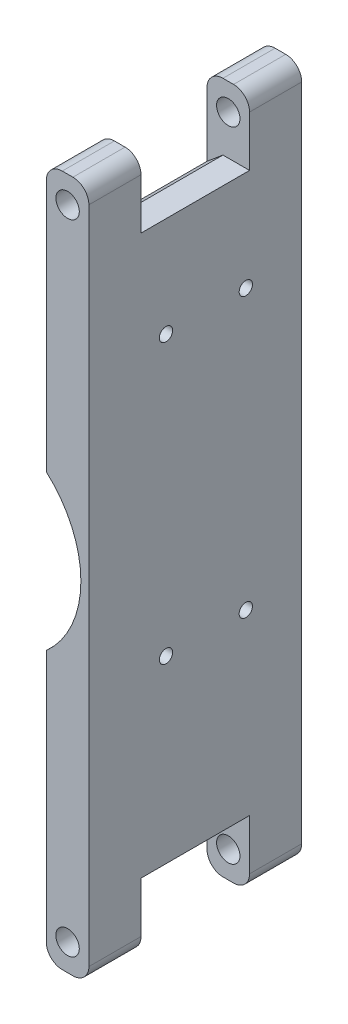
ISO-10303-21;
HEADER;
FILE_DESCRIPTION(('STEP AP214'),'2;1');
FILE_NAME('part.step','',(''),(''),'','','');
FILE_SCHEMA(('AUTOMOTIVE_DESIGN { 1 0 10303 214 1 1 1 1 }'));
ENDSEC;
DATA;
#1=APPLICATION_CONTEXT('core data for automotive mechanical design processes');
#2=APPLICATION_PROTOCOL_DEFINITION('international standard','automotive_design',2000,#1);
#3=PRODUCT_CONTEXT('',#1,'mechanical');
#4=PRODUCT('Part','Part','',(#3));
#5=PRODUCT_RELATED_PRODUCT_CATEGORY('part','',(#4));
#6=PRODUCT_DEFINITION_FORMATION('','',#4);
#7=PRODUCT_DEFINITION_CONTEXT('part definition',#1,'design');
#8=PRODUCT_DEFINITION('design','',#6,#7);
#9=PRODUCT_DEFINITION_SHAPE('','',#8);
#10=(LENGTH_UNIT() NAMED_UNIT(*) SI_UNIT(.MILLI.,.METRE.));
#11=(NAMED_UNIT(*) PLANE_ANGLE_UNIT() SI_UNIT($,.RADIAN.));
#12=(NAMED_UNIT(*) SI_UNIT($,.STERADIAN.) SOLID_ANGLE_UNIT());
#13=UNCERTAINTY_MEASURE_WITH_UNIT(LENGTH_MEASURE(1.E-05),#10,'distance_accuracy_value','');
#14=(GEOMETRIC_REPRESENTATION_CONTEXT(3) GLOBAL_UNCERTAINTY_ASSIGNED_CONTEXT((#13)) GLOBAL_UNIT_ASSIGNED_CONTEXT((#10,
#11,#12)) REPRESENTATION_CONTEXT('',''));
#15=CARTESIAN_POINT('',(0.,0.,0.));
#16=DIRECTION('',(0.,0.,1.));
#17=DIRECTION('',(1.,0.,0.));
#18=AXIS2_PLACEMENT_3D('',#15,#16,#17);
#19=CARTESIAN_POINT('',(-3.99999999999999,-65.,-40.));
#20=DIRECTION('',(0.,-1.,0.));
#21=DIRECTION('',(0.,0.,-1.));
#22=AXIS2_PLACEMENT_3D('',#19,#20,#21);
#23=PLANE('',#22);
#24=DIRECTION('',(1.,0.,0.));
#25=VECTOR('',#24,1.);
#26=CARTESIAN_POINT('',(-3.99999999999999,-65.,0.));
#27=LINE('',#26,#25);
#28=CARTESIAN_POINT('',(-0.99999999999999,-65.,0.));
#29=VERTEX_POINT('',#28);
#30=CARTESIAN_POINT('',(1.00000000000001,-65.,0.));
#31=VERTEX_POINT('',#30);
#32=EDGE_CURVE('E394',#29,#31,#27,.T.);
#33=ORIENTED_EDGE('',*,*,#32,.F.);
#34=DIRECTION('',(0.,0.,1.));
#35=VECTOR('',#34,1.);
#36=CARTESIAN_POINT('',(-0.99999999999999,-65.,-40.));
#37=LINE('',#36,#35);
#38=CARTESIAN_POINT('',(-0.99999999999999,-65.,-9.8));
#39=VERTEX_POINT('',#38);
#40=EDGE_CURVE('E311',#29,#39,#37,.F.);
#41=ORIENTED_EDGE('',*,*,#40,.T.);
#42=DIRECTION('',(-1.,0.,0.));
#43=VECTOR('',#42,1.);
#44=CARTESIAN_POINT('',(-3.99999999999999,-65.,-9.8));
#45=LINE('',#44,#43);
#46=CARTESIAN_POINT('',(1.00000000000001,-65.,-9.8));
#47=VERTEX_POINT('',#46);
#48=EDGE_CURVE('E386',#47,#39,#45,.T.);
#49=ORIENTED_EDGE('',*,*,#48,.F.);
#50=DIRECTION('',(0.,0.,1.));
#51=VECTOR('',#50,1.);
#52=CARTESIAN_POINT('',(1.00000000000001,-65.,-40.));
#53=LINE('',#52,#51);
#54=EDGE_CURVE('E308',#47,#31,#53,.T.);
#55=ORIENTED_EDGE('',*,*,#54,.T.);
#56=EDGE_LOOP('',(#33,#41,#49,#55));
#57=FACE_BOUND('',#56,.T.);
#58=ADVANCED_FACE('F39',(#57),#23,.T.);
#59=CARTESIAN_POINT('',(-4.00000000000001,65.,-40.));
#60=DIRECTION('',(0.,1.,0.));
#61=DIRECTION('',(0.,0.,1.));
#62=AXIS2_PLACEMENT_3D('',#59,#60,#61);
#63=PLANE('',#62);
#64=DIRECTION('',(-1.,0.,0.));
#65=VECTOR('',#64,1.);
#66=CARTESIAN_POINT('',(-4.00000000000001,65.,-40.));
#67=LINE('',#66,#65);
#68=CARTESIAN_POINT('',(0.999999999999995,65.,-40.));
#69=VERTEX_POINT('',#68);
#70=CARTESIAN_POINT('',(-1.00000000000001,65.,-40.));
#71=VERTEX_POINT('',#70);
#72=EDGE_CURVE('E393',#69,#71,#67,.T.);
#73=ORIENTED_EDGE('',*,*,#72,.T.);
#74=DIRECTION('',(0.,0.,1.));
#75=VECTOR('',#74,1.);
#76=CARTESIAN_POINT('',(-1.00000000000001,65.,-40.));
#77=LINE('',#76,#75);
#78=CARTESIAN_POINT('',(-1.00000000000001,65.,-30.2));
#79=VERTEX_POINT('',#78);
#80=EDGE_CURVE('E328',#71,#79,#77,.T.);
#81=ORIENTED_EDGE('',*,*,#80,.T.);
#82=DIRECTION('',(-1.,0.,0.));
#83=VECTOR('',#82,1.);
#84=CARTESIAN_POINT('',(-4.00000000000001,65.,-30.2));
#85=LINE('',#84,#83);
#86=CARTESIAN_POINT('',(0.999999999999995,65.,-30.2));
#87=VERTEX_POINT('',#86);
#88=EDGE_CURVE('E260',#87,#79,#85,.T.);
#89=ORIENTED_EDGE('',*,*,#88,.F.);
#90=DIRECTION('',(0.,0.,1.));
#91=VECTOR('',#90,1.);
#92=CARTESIAN_POINT('',(0.999999999999995,65.,-40.));
#93=LINE('',#92,#91);
#94=EDGE_CURVE('E326',#87,#69,#93,.F.);
#95=ORIENTED_EDGE('',*,*,#94,.T.);
#96=EDGE_LOOP('',(#73,#81,#89,#95));
#97=FACE_BOUND('',#96,.T.);
#98=ADVANCED_FACE('F456',(#97),#63,.T.);
#99=CARTESIAN_POINT('',(3.99999999999999,65.,-40.));
#100=DIRECTION('',(1.,0.,0.));
#101=DIRECTION('',(0.,1.,0.));
#102=AXIS2_PLACEMENT_3D('',#99,#100,#101);
#103=PLANE('',#102);
#104=CARTESIAN_POINT('',(4.,-18.7,-29.5));
#105=DIRECTION('',(1.,0.,0.));
#106=DIRECTION('',(0.,1.,0.));
#107=AXIS2_PLACEMENT_3D('',#104,#105,#106);
#108=CIRCLE('',#107,1.25);
#109=CARTESIAN_POINT('',(4.,-17.45,-29.5));
#110=VERTEX_POINT('',#109);
#111=EDGE_CURVE('E579',#110,#110,#108,.F.);
#112=ORIENTED_EDGE('',*,*,#111,.T.);
#113=EDGE_LOOP('',(#112));
#114=FACE_BOUND('',#113,.T.);
#115=CARTESIAN_POINT('',(4.,33.7,-14.5));
#116=DIRECTION('',(1.,0.,0.));
#117=DIRECTION('',(0.,1.,0.));
#118=AXIS2_PLACEMENT_3D('',#115,#116,#117);
#119=CIRCLE('',#118,1.25);
#120=CARTESIAN_POINT('',(4.,34.95,-14.5));
#121=VERTEX_POINT('',#120);
#122=EDGE_CURVE('E586',#121,#121,#119,.F.);
#123=ORIENTED_EDGE('',*,*,#122,.T.);
#124=EDGE_LOOP('',(#123));
#125=FACE_BOUND('',#124,.T.);
#126=CARTESIAN_POINT('',(4.,-18.7,-14.5));
#127=DIRECTION('',(1.,0.,0.));
#128=DIRECTION('',(0.,1.,0.));
#129=AXIS2_PLACEMENT_3D('',#126,#127,#128);
#130=CIRCLE('',#129,1.25);
#131=CARTESIAN_POINT('',(4.,-17.45,-14.5));
#132=VERTEX_POINT('',#131);
#133=EDGE_CURVE('E570',#132,#132,#130,.F.);
#134=ORIENTED_EDGE('',*,*,#133,.T.);
#135=EDGE_LOOP('',(#134));
#136=FACE_BOUND('',#135,.T.);
#137=CARTESIAN_POINT('',(4.,33.7,-29.5));
#138=DIRECTION('',(1.,0.,0.));
#139=DIRECTION('',(0.,1.,0.));
#140=AXIS2_PLACEMENT_3D('',#137,#138,#139);
#141=CIRCLE('',#140,1.25);
#142=CARTESIAN_POINT('',(4.,34.95,-29.5));
#143=VERTEX_POINT('',#142);
#144=EDGE_CURVE('E582',#143,#143,#141,.F.);
#145=ORIENTED_EDGE('',*,*,#144,.T.);
#146=EDGE_LOOP('',(#145));
#147=FACE_BOUND('',#146,.T.);
#148=DIRECTION('',(0.,1.,0.));
#149=VECTOR('',#148,1.);
#150=CARTESIAN_POINT('',(4.00000000000001,-77.5,-30.2));
#151=LINE('',#150,#149);
#152=CARTESIAN_POINT('',(4.00000000000001,-62.,-30.2));
#153=VERTEX_POINT('',#152);
#154=CARTESIAN_POINT('',(4.00000000000001,-52.5,-30.2));
#155=VERTEX_POINT('',#154);
#156=EDGE_CURVE('E379',#153,#155,#151,.T.);
#157=ORIENTED_EDGE('',*,*,#156,.F.);
#158=DIRECTION('',(0.,0.,1.));
#159=VECTOR('',#158,1.);
#160=CARTESIAN_POINT('',(4.00000000000001,-62.,-40.));
#161=LINE('',#160,#159);
#162=CARTESIAN_POINT('',(4.00000000000001,-62.,-40.));
#163=VERTEX_POINT('',#162);
#164=EDGE_CURVE('E298',#153,#163,#161,.F.);
#165=ORIENTED_EDGE('',*,*,#164,.T.);
#166=DIRECTION('',(0.,1.,0.));
#167=VECTOR('',#166,1.);
#168=CARTESIAN_POINT('',(3.99999999999999,65.,-40.));
#169=LINE('',#168,#167);
#170=CARTESIAN_POINT('',(3.99999999999999,62.,-40.));
#171=VERTEX_POINT('',#170);
#172=EDGE_CURVE('E390',#163,#171,#169,.T.);
#173=ORIENTED_EDGE('',*,*,#172,.T.);
#174=DIRECTION('',(0.,0.,1.));
#175=VECTOR('',#174,1.);
#176=CARTESIAN_POINT('',(3.99999999999999,62.,-40.));
#177=LINE('',#176,#175);
#178=CARTESIAN_POINT('',(3.99999999999999,62.,-30.2));
#179=VERTEX_POINT('',#178);
#180=EDGE_CURVE('E293',#171,#179,#177,.T.);
#181=ORIENTED_EDGE('',*,*,#180,.T.);
#182=DIRECTION('',(0.,1.,0.));
#183=VECTOR('',#182,1.);
#184=CARTESIAN_POINT('',(3.99999999999999,77.5,-30.2));
#185=LINE('',#184,#183);
#186=CARTESIAN_POINT('',(4.,52.5,-30.2));
#187=VERTEX_POINT('',#186);
#188=EDGE_CURVE('E361',#187,#179,#185,.T.);
#189=ORIENTED_EDGE('',*,*,#188,.F.);
#190=DIRECTION('',(0.,0.,-1.));
#191=VECTOR('',#190,1.);
#192=CARTESIAN_POINT('',(4.,52.5,-9.8));
#193=LINE('',#192,#191);
#194=CARTESIAN_POINT('',(4.,52.5,-9.8));
#195=VERTEX_POINT('',#194);
#196=EDGE_CURVE('E358',#195,#187,#193,.T.);
#197=ORIENTED_EDGE('',*,*,#196,.F.);
#198=DIRECTION('',(0.,-1.,0.));
#199=VECTOR('',#198,1.);
#200=CARTESIAN_POINT('',(3.99999999999999,77.5,-9.8));
#201=LINE('',#200,#199);
#202=CARTESIAN_POINT('',(3.99999999999999,62.,-9.8));
#203=VERTEX_POINT('',#202);
#204=EDGE_CURVE('E364',#203,#195,#201,.T.);
#205=ORIENTED_EDGE('',*,*,#204,.F.);
#206=DIRECTION('',(0.,0.,1.));
#207=VECTOR('',#206,1.);
#208=CARTESIAN_POINT('',(3.99999999999999,62.,-40.));
#209=LINE('',#208,#207);
#210=CARTESIAN_POINT('',(3.99999999999999,62.,0.));
#211=VERTEX_POINT('',#210);
#212=EDGE_CURVE('E290',#203,#211,#209,.T.);
#213=ORIENTED_EDGE('',*,*,#212,.T.);
#214=DIRECTION('',(0.,1.,0.));
#215=VECTOR('',#214,1.);
#216=CARTESIAN_POINT('',(3.99999999999999,65.,0.));
#217=LINE('',#216,#215);
#218=CARTESIAN_POINT('',(4.00000000000001,-62.,0.));
#219=VERTEX_POINT('',#218);
#220=EDGE_CURVE('E389',#219,#211,#217,.T.);
#221=ORIENTED_EDGE('',*,*,#220,.F.);
#222=DIRECTION('',(0.,0.,1.));
#223=VECTOR('',#222,1.);
#224=CARTESIAN_POINT('',(4.00000000000001,-62.,-40.));
#225=LINE('',#224,#223);
#226=CARTESIAN_POINT('',(4.00000000000001,-62.,-9.8));
#227=VERTEX_POINT('',#226);
#228=EDGE_CURVE('E296',#219,#227,#225,.F.);
#229=ORIENTED_EDGE('',*,*,#228,.T.);
#230=DIRECTION('',(0.,-1.,0.));
#231=VECTOR('',#230,1.);
#232=CARTESIAN_POINT('',(4.00000000000001,-77.5,-9.8));
#233=LINE('',#232,#231);
#234=CARTESIAN_POINT('',(4.00000000000001,-52.5,-9.8));
#235=VERTEX_POINT('',#234);
#236=EDGE_CURVE('E365',#235,#227,#233,.T.);
#237=ORIENTED_EDGE('',*,*,#236,.F.);
#238=DIRECTION('',(0.,0.,1.));
#239=VECTOR('',#238,1.);
#240=CARTESIAN_POINT('',(4.00000000000001,-52.5,-9.8));
#241=LINE('',#240,#239);
#242=EDGE_CURVE('E376',#155,#235,#241,.T.);
#243=ORIENTED_EDGE('',*,*,#242,.F.);
#244=EDGE_LOOP('',(#157,#165,#173,#181,#189,#197,#205,#213,#221,#229,#237,#243));
#245=FACE_BOUND('',#244,.T.);
#246=ADVANCED_FACE('F428',(#114,#125,#136,#147,#245),#103,.T.);
#247=DIRECTION('',(1.,0.,0.));
#248=VECTOR('',#247,1.);
#249=CARTESIAN_POINT('',(-3.99999999999999,-65.,-30.2));
#250=LINE('',#249,#248);
#251=CARTESIAN_POINT('',(-0.99999999999999,-65.,-30.2));
#252=VERTEX_POINT('',#251);
#253=CARTESIAN_POINT('',(1.00000000000001,-65.,-30.2));
#254=VERTEX_POINT('',#253);
#255=EDGE_CURVE('E372',#252,#254,#250,.T.);
#256=ORIENTED_EDGE('',*,*,#255,.F.);
#257=DIRECTION('',(0.,0.,1.));
#258=VECTOR('',#257,1.);
#259=CARTESIAN_POINT('',(-0.99999999999999,-65.,-40.));
#260=LINE('',#259,#258);
#261=CARTESIAN_POINT('',(-0.99999999999999,-65.,-40.));
#262=VERTEX_POINT('',#261);
#263=EDGE_CURVE('E280',#252,#262,#260,.F.);
#264=ORIENTED_EDGE('',*,*,#263,.T.);
#265=DIRECTION('',(1.,0.,0.));
#266=VECTOR('',#265,1.);
#267=CARTESIAN_POINT('',(-3.99999999999999,-65.,-40.));
#268=LINE('',#267,#266);
#269=CARTESIAN_POINT('',(1.00000000000001,-65.,-40.));
#270=VERTEX_POINT('',#269);
#271=EDGE_CURVE('E399',#262,#270,#268,.T.);
#272=ORIENTED_EDGE('',*,*,#271,.T.);
#273=DIRECTION('',(0.,0.,1.));
#274=VECTOR('',#273,1.);
#275=CARTESIAN_POINT('',(1.00000000000001,-65.,-40.));
#276=LINE('',#275,#274);
#277=EDGE_CURVE('E277',#270,#254,#276,.T.);
#278=ORIENTED_EDGE('',*,*,#277,.T.);
#279=EDGE_LOOP('',(#256,#264,#272,#278));
#280=FACE_BOUND('',#279,.T.);
#281=ADVANCED_FACE('F463',(#280),#23,.T.);
#282=CARTESIAN_POINT('',(-4.00000000000001,65.,-40.));
#283=DIRECTION('',(-1.,0.,0.));
#284=DIRECTION('',(0.,-1.,0.));
#285=AXIS2_PLACEMENT_3D('',#282,#283,#284);
#286=PLANE('',#285);
#287=CARTESIAN_POINT('',(-4.,-18.7,-29.5));
#288=DIRECTION('',(-1.,0.,0.));
#289=DIRECTION('',(0.,1.,0.));
#290=AXIS2_PLACEMENT_3D('',#287,#288,#289);
#291=CIRCLE('',#290,1.25);
#292=CARTESIAN_POINT('',(-4.,-17.45,-29.5));
#293=VERTEX_POINT('',#292);
#294=EDGE_CURVE('E583',#293,#293,#291,.T.);
#295=ORIENTED_EDGE('',*,*,#294,.F.);
#296=EDGE_LOOP('',(#295));
#297=FACE_BOUND('',#296,.T.);
#298=CARTESIAN_POINT('',(-4.,33.7,-14.5));
#299=DIRECTION('',(-1.,0.,0.));
#300=DIRECTION('',(0.,1.,0.));
#301=AXIS2_PLACEMENT_3D('',#298,#299,#300);
#302=CIRCLE('',#301,1.25);
#303=CARTESIAN_POINT('',(-4.,34.95,-14.5));
#304=VERTEX_POINT('',#303);
#305=EDGE_CURVE('E576',#304,#304,#302,.T.);
#306=ORIENTED_EDGE('',*,*,#305,.F.);
#307=EDGE_LOOP('',(#306));
#308=FACE_BOUND('',#307,.T.);
#309=CARTESIAN_POINT('',(-4.,-18.7,-14.5));
#310=DIRECTION('',(-1.,0.,0.));
#311=DIRECTION('',(0.,-1.,0.));
#312=AXIS2_PLACEMENT_3D('',#309,#310,#311);
#313=CIRCLE('',#312,1.25);
#314=CARTESIAN_POINT('',(-4.,-19.95,-14.5));
#315=VERTEX_POINT('',#314);
#316=EDGE_CURVE('E573',#315,#315,#313,.T.);
#317=ORIENTED_EDGE('',*,*,#316,.F.);
#318=EDGE_LOOP('',(#317));
#319=FACE_BOUND('',#318,.T.);
#320=CARTESIAN_POINT('',(-4.,33.7,-29.5));
#321=DIRECTION('',(-1.,0.,0.));
#322=DIRECTION('',(0.,-1.,0.));
#323=AXIS2_PLACEMENT_3D('',#320,#321,#322);
#324=CIRCLE('',#323,1.25);
#325=CARTESIAN_POINT('',(-4.,32.45,-29.5));
#326=VERTEX_POINT('',#325);
#327=EDGE_CURVE('E216',#326,#326,#324,.T.);
#328=ORIENTED_EDGE('',*,*,#327,.F.);
#329=EDGE_LOOP('',(#328));
#330=FACE_BOUND('',#329,.T.);
#331=DIRECTION('',(0.,0.,1.));
#332=VECTOR('',#331,1.);
#333=CARTESIAN_POINT('',(-3.99999999999999,-49.9827011064682,-9.8));
#334=LINE('',#333,#332);
#335=CARTESIAN_POINT('',(-3.99999999999999,-49.9827011064682,-30.2));
#336=VERTEX_POINT('',#335);
#337=CARTESIAN_POINT('',(-3.99999999999999,-49.9827011064682,-9.8));
#338=VERTEX_POINT('',#337);
#339=EDGE_CURVE('E224',#336,#338,#334,.T.);
#340=ORIENTED_EDGE('',*,*,#339,.T.);
#341=DIRECTION('',(0.,-1.,0.));
#342=VECTOR('',#341,1.);
#343=CARTESIAN_POINT('',(-4.,-77.5,-9.8));
#344=LINE('',#343,#342);
#345=CARTESIAN_POINT('',(-4.00000000000001,-62.,-9.8));
#346=VERTEX_POINT('',#345);
#347=EDGE_CURVE('E253',#338,#346,#344,.T.);
#348=ORIENTED_EDGE('',*,*,#347,.T.);
#349=DIRECTION('',(0.,0.,1.));
#350=VECTOR('',#349,1.);
#351=CARTESIAN_POINT('',(-3.99999999999999,-62.,-40.));
#352=LINE('',#351,#350);
#353=CARTESIAN_POINT('',(-3.99999999999999,-62.,0.));
#354=VERTEX_POINT('',#353);
#355=EDGE_CURVE('E270',#346,#354,#352,.T.);
#356=ORIENTED_EDGE('',*,*,#355,.T.);
#357=DIRECTION('',(0.,-1.,0.));
#358=VECTOR('',#357,1.);
#359=CARTESIAN_POINT('',(-4.00000000000001,65.,0.));
#360=LINE('',#359,#358);
#361=CARTESIAN_POINT('',(-4.,-14.5344418537486,0.));
#362=VERTEX_POINT('',#361);
#363=EDGE_CURVE('E407',#362,#354,#360,.T.);
#364=ORIENTED_EDGE('',*,*,#363,.F.);
#365=DIRECTION('',(0.,0.,1.));
#366=VECTOR('',#365,1.);
#367=CARTESIAN_POINT('',(-4.,-14.5344418537486,-7.3));
#368=LINE('',#367,#366);
#369=CARTESIAN_POINT('',(-4.,-14.5344418537486,-7.3));
#370=VERTEX_POINT('',#369);
#371=EDGE_CURVE('E211',#370,#362,#368,.T.);
#372=ORIENTED_EDGE('',*,*,#371,.F.);
#373=DIRECTION('',(0.,1.,0.));
#374=VECTOR('',#373,1.);
#375=CARTESIAN_POINT('',(-4.00000000000001,65.,-7.3));
#376=LINE('',#375,#374);
#377=CARTESIAN_POINT('',(-4.,14.5344418537486,-7.3));
#378=VERTEX_POINT('',#377);
#379=EDGE_CURVE('E215',#370,#378,#376,.T.);
#380=ORIENTED_EDGE('',*,*,#379,.T.);
#381=DIRECTION('',(0.,0.,1.));
#382=VECTOR('',#381,1.);
#383=CARTESIAN_POINT('',(-4.,14.5344418537486,-7.3));
#384=LINE('',#383,#382);
#385=CARTESIAN_POINT('',(-4.,14.5344418537486,0.));
#386=VERTEX_POINT('',#385);
#387=EDGE_CURVE('E200',#386,#378,#384,.F.);
#388=ORIENTED_EDGE('',*,*,#387,.F.);
#389=CARTESIAN_POINT('',(-4.00000000000001,62.,0.));
#390=VERTEX_POINT('',#389);
#391=EDGE_CURVE('E408',#390,#386,#360,.T.);
#392=ORIENTED_EDGE('',*,*,#391,.F.);
#393=DIRECTION('',(0.,0.,1.));
#394=VECTOR('',#393,1.);
#395=CARTESIAN_POINT('',(-4.00000000000001,62.,-40.));
#396=LINE('',#395,#394);
#397=CARTESIAN_POINT('',(-4.00000000000002,62.,-9.8));
#398=VERTEX_POINT('',#397);
#399=EDGE_CURVE('E262',#390,#398,#396,.F.);
#400=ORIENTED_EDGE('',*,*,#399,.T.);
#401=DIRECTION('',(0.,-1.,0.));
#402=VECTOR('',#401,1.);
#403=CARTESIAN_POINT('',(-4.00000000000002,77.5,-9.8));
#404=LINE('',#403,#402);
#405=CARTESIAN_POINT('',(-4.00000000000002,49.9827011064681,-9.8));
#406=VERTEX_POINT('',#405);
#407=EDGE_CURVE('E357',#398,#406,#404,.T.);
#408=ORIENTED_EDGE('',*,*,#407,.T.);
#409=DIRECTION('',(0.,0.,-1.));
#410=VECTOR('',#409,1.);
#411=CARTESIAN_POINT('',(-4.,49.9827011064681,-30.2));
#412=LINE('',#411,#410);
#413=CARTESIAN_POINT('',(-4.,49.9827011064681,-30.2));
#414=VERTEX_POINT('',#413);
#415=EDGE_CURVE('E221',#406,#414,#412,.T.);
#416=ORIENTED_EDGE('',*,*,#415,.T.);
#417=DIRECTION('',(0.,1.,0.));
#418=VECTOR('',#417,1.);
#419=CARTESIAN_POINT('',(-4.00000000000002,77.5,-30.2));
#420=LINE('',#419,#418);
#421=CARTESIAN_POINT('',(-4.00000000000002,62.,-30.2));
#422=VERTEX_POINT('',#421);
#423=EDGE_CURVE('E354',#414,#422,#420,.T.);
#424=ORIENTED_EDGE('',*,*,#423,.T.);
#425=DIRECTION('',(0.,0.,1.));
#426=VECTOR('',#425,1.);
#427=CARTESIAN_POINT('',(-4.00000000000001,62.,-40.));
#428=LINE('',#427,#426);
#429=CARTESIAN_POINT('',(-4.00000000000001,62.,-40.));
#430=VERTEX_POINT('',#429);
#431=EDGE_CURVE('E259',#422,#430,#428,.F.);
#432=ORIENTED_EDGE('',*,*,#431,.T.);
#433=DIRECTION('',(0.,-1.,0.));
#434=VECTOR('',#433,1.);
#435=CARTESIAN_POINT('',(-4.00000000000001,65.,-40.));
#436=LINE('',#435,#434);
#437=CARTESIAN_POINT('',(-3.99999999999999,-62.,-40.));
#438=VERTEX_POINT('',#437);
#439=EDGE_CURVE('E397',#430,#438,#436,.T.);
#440=ORIENTED_EDGE('',*,*,#439,.T.);
#441=DIRECTION('',(0.,0.,1.));
#442=VECTOR('',#441,1.);
#443=CARTESIAN_POINT('',(-3.99999999999999,-62.,-40.));
#444=LINE('',#443,#442);
#445=CARTESIAN_POINT('',(-3.99999999999999,-62.,-30.2));
#446=VERTEX_POINT('',#445);
#447=EDGE_CURVE('E258',#438,#446,#444,.T.);
#448=ORIENTED_EDGE('',*,*,#447,.T.);
#449=DIRECTION('',(0.,-1.,0.));
#450=VECTOR('',#449,1.);
#451=CARTESIAN_POINT('',(-4.00000000000001,65.,-30.2));
#452=LINE('',#451,#450);
#453=EDGE_CURVE('E244',#336,#446,#452,.T.);
#454=ORIENTED_EDGE('',*,*,#453,.F.);
#455=EDGE_LOOP('',(#340,#348,#356,#364,#372,#380,#388,#392,#400,#408,#416,#424,#432,#440,#448,#454));
#456=FACE_BOUND('',#455,.T.);
#457=ADVANCED_FACE('F219',(#297,#308,#319,#330,#456),#286,.T.);
#458=DIRECTION('',(1.,0.,0.));
#459=VECTOR('',#458,1.);
#460=CARTESIAN_POINT('',(-4.00000000000001,65.,-9.8));
#461=LINE('',#460,#459);
#462=CARTESIAN_POINT('',(-1.00000000000001,65.,-9.8));
#463=VERTEX_POINT('',#462);
#464=CARTESIAN_POINT('',(0.999999999999995,65.,-9.8));
#465=VERTEX_POINT('',#464);
#466=EDGE_CURVE('E265',#463,#465,#461,.T.);
#467=ORIENTED_EDGE('',*,*,#466,.F.);
#468=DIRECTION('',(0.,0.,1.));
#469=VECTOR('',#468,1.);
#470=CARTESIAN_POINT('',(-1.00000000000001,65.,-40.));
#471=LINE('',#470,#469);
#472=CARTESIAN_POINT('',(-1.00000000000001,65.,0.));
#473=VERTEX_POINT('',#472);
#474=EDGE_CURVE('E319',#463,#473,#471,.T.);
#475=ORIENTED_EDGE('',*,*,#474,.T.);
#476=DIRECTION('',(-1.,0.,0.));
#477=VECTOR('',#476,1.);
#478=CARTESIAN_POINT('',(-4.00000000000001,65.,0.));
#479=LINE('',#478,#477);
#480=CARTESIAN_POINT('',(0.999999999999995,65.,0.));
#481=VERTEX_POINT('',#480);
#482=EDGE_CURVE('E404',#481,#473,#479,.T.);
#483=ORIENTED_EDGE('',*,*,#482,.F.);
#484=DIRECTION('',(0.,0.,1.));
#485=VECTOR('',#484,1.);
#486=CARTESIAN_POINT('',(0.999999999999995,65.,-40.));
#487=LINE('',#486,#485);
#488=EDGE_CURVE('E317',#481,#465,#487,.F.);
#489=ORIENTED_EDGE('',*,*,#488,.T.);
#490=EDGE_LOOP('',(#467,#475,#483,#489));
#491=FACE_BOUND('',#490,.T.);
#492=ADVANCED_FACE('F452',(#491),#63,.T.);
#493=CARTESIAN_POINT('',(0.,0.,-40.));
#494=DIRECTION('',(0.,0.,1.));
#495=DIRECTION('',(1.,0.,0.));
#496=AXIS2_PLACEMENT_3D('',#493,#494,#495);
#497=PLANE('',#496);
#498=CARTESIAN_POINT('',(0.,60.,-40.));
#499=DIRECTION('',(0.,0.,1.));
#500=DIRECTION('',(1.,0.,0.));
#501=AXIS2_PLACEMENT_3D('',#498,#499,#500);
#502=CIRCLE('',#501,2.2);
#503=CARTESIAN_POINT('',(2.2,60.,-40.));
#504=VERTEX_POINT('',#503);
#505=EDGE_CURVE('E337',#504,#504,#502,.T.);
#506=ORIENTED_EDGE('',*,*,#505,.T.);
#507=EDGE_LOOP('',(#506));
#508=FACE_BOUND('',#507,.T.);
#509=CARTESIAN_POINT('',(0.,-60.,-40.));
#510=DIRECTION('',(0.,0.,1.));
#511=DIRECTION('',(-1.,0.,0.));
#512=AXIS2_PLACEMENT_3D('',#509,#510,#511);
#513=CIRCLE('',#512,2.2);
#514=CARTESIAN_POINT('',(-2.2,-60.,-40.));
#515=VERTEX_POINT('',#514);
#516=EDGE_CURVE('E351',#515,#515,#513,.T.);
#517=ORIENTED_EDGE('',*,*,#516,.T.);
#518=EDGE_LOOP('',(#517));
#519=FACE_BOUND('',#518,.T.);
#520=ORIENTED_EDGE('',*,*,#271,.F.);
#521=CARTESIAN_POINT('',(-0.99999999999999,-62.,-40.));
#522=DIRECTION('',(0.,0.,1.));
#523=DIRECTION('',(1.,0.,0.));
#524=AXIS2_PLACEMENT_3D('',#521,#522,#523);
#525=CIRCLE('',#524,3.);
#526=EDGE_CURVE('E288',#262,#438,#525,.F.);
#527=ORIENTED_EDGE('',*,*,#526,.T.);
#528=ORIENTED_EDGE('',*,*,#439,.F.);
#529=CARTESIAN_POINT('',(-1.00000000000001,62.,-40.));
#530=DIRECTION('',(0.,0.,1.));
#531=DIRECTION('',(1.,0.,0.));
#532=AXIS2_PLACEMENT_3D('',#529,#530,#531);
#533=CIRCLE('',#532,3.);
#534=EDGE_CURVE('E284',#430,#71,#533,.F.);
#535=ORIENTED_EDGE('',*,*,#534,.T.);
#536=ORIENTED_EDGE('',*,*,#72,.F.);
#537=CARTESIAN_POINT('',(0.999999999999994,62.,-40.));
#538=DIRECTION('',(0.,0.,1.));
#539=DIRECTION('',(1.,0.,0.));
#540=AXIS2_PLACEMENT_3D('',#537,#538,#539);
#541=CIRCLE('',#540,3.);
#542=EDGE_CURVE('E282',#69,#171,#541,.F.);
#543=ORIENTED_EDGE('',*,*,#542,.T.);
#544=ORIENTED_EDGE('',*,*,#172,.F.);
#545=CARTESIAN_POINT('',(1.00000000000001,-62.,-40.));
#546=DIRECTION('',(0.,0.,1.));
#547=DIRECTION('',(1.,0.,0.));
#548=AXIS2_PLACEMENT_3D('',#545,#546,#547);
#549=CIRCLE('',#548,3.);
#550=EDGE_CURVE('E286',#163,#270,#549,.F.);
#551=ORIENTED_EDGE('',*,*,#550,.T.);
#552=EDGE_LOOP('',(#520,#527,#528,#535,#536,#543,#544,#551));
#553=FACE_BOUND('',#552,.T.);
#554=ADVANCED_FACE('F454',(#508,#519,#553),#497,.F.);
#555=CARTESIAN_POINT('',(0.,0.,0.));
#556=DIRECTION('',(0.,0.,1.));
#557=DIRECTION('',(1.,0.,0.));
#558=AXIS2_PLACEMENT_3D('',#555,#556,#557);
#559=PLANE('',#558);
#560=CARTESIAN_POINT('',(-17.,0.,0.));
#561=DIRECTION('',(0.,0.,1.));
#562=DIRECTION('',(1.,0.,0.));
#563=AXIS2_PLACEMENT_3D('',#560,#561,#562);
#564=CIRCLE('',#563,19.5);
#565=EDGE_CURVE('E206',#362,#386,#564,.T.);
#566=ORIENTED_EDGE('',*,*,#565,.F.);
#567=ORIENTED_EDGE('',*,*,#363,.T.);
#568=CARTESIAN_POINT('',(-0.99999999999999,-62.,0.));
#569=DIRECTION('',(0.,0.,1.));
#570=DIRECTION('',(1.,0.,0.));
#571=AXIS2_PLACEMENT_3D('',#568,#569,#570);
#572=CIRCLE('',#571,3.);
#573=EDGE_CURVE('E306',#354,#29,#572,.T.);
#574=ORIENTED_EDGE('',*,*,#573,.T.);
#575=ORIENTED_EDGE('',*,*,#32,.T.);
#576=CARTESIAN_POINT('',(1.00000000000001,-62.,0.));
#577=DIRECTION('',(0.,0.,1.));
#578=DIRECTION('',(1.,0.,0.));
#579=AXIS2_PLACEMENT_3D('',#576,#577,#578);
#580=CIRCLE('',#579,3.);
#581=EDGE_CURVE('E304',#31,#219,#580,.T.);
#582=ORIENTED_EDGE('',*,*,#581,.T.);
#583=ORIENTED_EDGE('',*,*,#220,.T.);
#584=CARTESIAN_POINT('',(0.999999999999994,62.,0.));
#585=DIRECTION('',(0.,0.,1.));
#586=DIRECTION('',(1.,0.,0.));
#587=AXIS2_PLACEMENT_3D('',#584,#585,#586);
#588=CIRCLE('',#587,3.);
#589=EDGE_CURVE('E300',#211,#481,#588,.T.);
#590=ORIENTED_EDGE('',*,*,#589,.T.);
#591=ORIENTED_EDGE('',*,*,#482,.T.);
#592=CARTESIAN_POINT('',(-1.00000000000001,62.,0.));
#593=DIRECTION('',(0.,0.,1.));
#594=DIRECTION('',(1.,0.,0.));
#595=AXIS2_PLACEMENT_3D('',#592,#593,#594);
#596=CIRCLE('',#595,3.);
#597=EDGE_CURVE('E302',#473,#390,#596,.T.);
#598=ORIENTED_EDGE('',*,*,#597,.T.);
#599=ORIENTED_EDGE('',*,*,#391,.T.);
#600=EDGE_LOOP('',(#566,#567,#574,#575,#582,#583,#590,#591,#598,#599));
#601=FACE_BOUND('',#600,.T.);
#602=CARTESIAN_POINT('',(0.,60.,0.));
#603=DIRECTION('',(0.,0.,1.));
#604=DIRECTION('',(1.,0.,0.));
#605=AXIS2_PLACEMENT_3D('',#602,#603,#604);
#606=CIRCLE('',#605,2.2);
#607=CARTESIAN_POINT('',(2.2,60.,0.));
#608=VERTEX_POINT('',#607);
#609=EDGE_CURVE('E598',#608,#608,#606,.T.);
#610=ORIENTED_EDGE('',*,*,#609,.F.);
#611=EDGE_LOOP('',(#610));
#612=FACE_BOUND('',#611,.T.);
#613=CARTESIAN_POINT('',(0.,-60.,0.));
#614=DIRECTION('',(0.,0.,1.));
#615=DIRECTION('',(-1.,0.,0.));
#616=AXIS2_PLACEMENT_3D('',#613,#614,#615);
#617=CIRCLE('',#616,2.2);
#618=CARTESIAN_POINT('',(-2.2,-60.,0.));
#619=VERTEX_POINT('',#618);
#620=EDGE_CURVE('E600',#619,#619,#617,.T.);
#621=ORIENTED_EDGE('',*,*,#620,.F.);
#622=EDGE_LOOP('',(#621));
#623=FACE_BOUND('',#622,.T.);
#624=ADVANCED_FACE('F432',(#601,#612,#623),#559,.T.);
#625=CARTESIAN_POINT('',(-4.00000000000002,77.5,-30.2));
#626=DIRECTION('',(0.,0.,-1.));
#627=DIRECTION('',(-1.,0.,0.));
#628=AXIS2_PLACEMENT_3D('',#625,#626,#627);
#629=PLANE('',#628);
#630=CARTESIAN_POINT('',(0.,60.,-30.2));
#631=DIRECTION('',(0.,0.,-1.));
#632=DIRECTION('',(-1.,0.,0.));
#633=AXIS2_PLACEMENT_3D('',#630,#631,#632);
#634=CIRCLE('',#633,2.2);
#635=CARTESIAN_POINT('',(-2.2,60.,-30.2));
#636=VERTEX_POINT('',#635);
#637=EDGE_CURVE('E340',#636,#636,#634,.T.);
#638=ORIENTED_EDGE('',*,*,#637,.T.);
#639=EDGE_LOOP('',(#638));
#640=FACE_BOUND('',#639,.T.);
#641=ORIENTED_EDGE('',*,*,#88,.T.);
#642=CARTESIAN_POINT('',(-1.00000000000001,62.,-30.2));
#643=DIRECTION('',(0.,0.,-1.));
#644=DIRECTION('',(-1.,0.,0.));
#645=AXIS2_PLACEMENT_3D('',#642,#643,#644);
#646=CIRCLE('',#645,3.);
#647=EDGE_CURVE('E226',#79,#422,#646,.F.);
#648=ORIENTED_EDGE('',*,*,#647,.T.);
#649=ORIENTED_EDGE('',*,*,#423,.F.);
#650=DIRECTION('',(0.766044443118979,0.642787609686538,0.));
#651=VECTOR('',#650,1.);
#652=CARTESIAN_POINT('',(9.54962464615219,61.352186149645,-30.2));
#653=LINE('',#652,#651);
#654=CARTESIAN_POINT('',(-1.,52.5,-30.2));
#655=VERTEX_POINT('',#654);
#656=EDGE_CURVE('E48',#414,#655,#653,.T.);
#657=ORIENTED_EDGE('',*,*,#656,.T.);
#658=DIRECTION('',(1.,0.,0.));
#659=VECTOR('',#658,1.);
#660=CARTESIAN_POINT('',(-4.00000000000002,52.5,-30.2));
#661=LINE('',#660,#659);
#662=EDGE_CURVE('E370',#655,#187,#661,.T.);
#663=ORIENTED_EDGE('',*,*,#662,.T.);
#664=ORIENTED_EDGE('',*,*,#188,.T.);
#665=CARTESIAN_POINT('',(0.999999999999994,62.,-30.2));
#666=DIRECTION('',(0.,0.,-1.));
#667=DIRECTION('',(-1.,0.,0.));
#668=AXIS2_PLACEMENT_3D('',#665,#666,#667);
#669=CIRCLE('',#668,3.);
#670=EDGE_CURVE('E331',#179,#87,#669,.F.);
#671=ORIENTED_EDGE('',*,*,#670,.T.);
#672=EDGE_LOOP('',(#641,#648,#649,#657,#663,#664,#671));
#673=FACE_BOUND('',#672,.T.);
#674=ADVANCED_FACE('F522',(#640,#673),#629,.F.);
#675=CARTESIAN_POINT('',(-4.00000000000002,52.5,-9.8));
#676=DIRECTION('',(0.,-1.,0.));
#677=DIRECTION('',(1.,0.,0.));
#678=AXIS2_PLACEMENT_3D('',#675,#676,#677);
#679=PLANE('',#678);
#680=ORIENTED_EDGE('',*,*,#662,.F.);
#681=DIRECTION('',(0.,0.,1.));
#682=VECTOR('',#681,1.);
#683=CARTESIAN_POINT('',(-1.,52.5,-9.8));
#684=LINE('',#683,#682);
#685=CARTESIAN_POINT('',(-1.,52.5,-9.8));
#686=VERTEX_POINT('',#685);
#687=EDGE_CURVE('E55',#655,#686,#684,.T.);
#688=ORIENTED_EDGE('',*,*,#687,.T.);
#689=DIRECTION('',(1.,0.,0.));
#690=VECTOR('',#689,1.);
#691=CARTESIAN_POINT('',(-4.00000000000002,52.5,-9.8));
#692=LINE('',#691,#690);
#693=EDGE_CURVE('E360',#686,#195,#692,.T.);
#694=ORIENTED_EDGE('',*,*,#693,.T.);
#695=ORIENTED_EDGE('',*,*,#196,.T.);
#696=EDGE_LOOP('',(#680,#688,#694,#695));
#697=FACE_BOUND('',#696,.T.);
#698=ADVANCED_FACE('F526',(#697),#679,.F.);
#699=CARTESIAN_POINT('',(-4.00000000000002,77.5,-9.8));
#700=DIRECTION('',(0.,0.,1.));
#701=DIRECTION('',(1.,0.,0.));
#702=AXIS2_PLACEMENT_3D('',#699,#700,#701);
#703=PLANE('',#702);
#704=CARTESIAN_POINT('',(0.,60.,-9.8));
#705=DIRECTION('',(0.,0.,1.));
#706=DIRECTION('',(1.,0.,0.));
#707=AXIS2_PLACEMENT_3D('',#704,#705,#706);
#708=CIRCLE('',#707,2.2);
#709=CARTESIAN_POINT('',(2.2,60.,-9.8));
#710=VERTEX_POINT('',#709);
#711=EDGE_CURVE('E338',#710,#710,#708,.T.);
#712=ORIENTED_EDGE('',*,*,#711,.T.);
#713=EDGE_LOOP('',(#712));
#714=FACE_BOUND('',#713,.T.);
#715=ORIENTED_EDGE('',*,*,#407,.F.);
#716=CARTESIAN_POINT('',(-1.00000000000001,62.,-9.8));
#717=DIRECTION('',(0.,0.,1.));
#718=DIRECTION('',(1.,0.,0.));
#719=AXIS2_PLACEMENT_3D('',#716,#717,#718);
#720=CIRCLE('',#719,3.);
#721=EDGE_CURVE('E324',#398,#463,#720,.F.);
#722=ORIENTED_EDGE('',*,*,#721,.T.);
#723=ORIENTED_EDGE('',*,*,#466,.T.);
#724=CARTESIAN_POINT('',(0.999999999999994,62.,-9.8));
#725=DIRECTION('',(0.,0.,1.));
#726=DIRECTION('',(1.,0.,0.));
#727=AXIS2_PLACEMENT_3D('',#724,#725,#726);
#728=CIRCLE('',#727,3.);
#729=EDGE_CURVE('E322',#465,#203,#728,.F.);
#730=ORIENTED_EDGE('',*,*,#729,.T.);
#731=ORIENTED_EDGE('',*,*,#204,.T.);
#732=ORIENTED_EDGE('',*,*,#693,.F.);
#733=DIRECTION('',(-0.766044443118979,-0.642787609686538,0.));
#734=VECTOR('',#733,1.);
#735=CARTESIAN_POINT('',(9.54962464615219,61.352186149645,-9.8));
#736=LINE('',#735,#734);
#737=EDGE_CURVE('E11',#686,#406,#736,.T.);
#738=ORIENTED_EDGE('',*,*,#737,.T.);
#739=EDGE_LOOP('',(#715,#722,#723,#730,#731,#732,#738));
#740=FACE_BOUND('',#739,.T.);
#741=ADVANCED_FACE('F416',(#714,#740),#703,.F.);
#742=CARTESIAN_POINT('',(-4.,-77.5,-9.8));
#743=DIRECTION('',(0.,0.,1.));
#744=DIRECTION('',(1.,0.,0.));
#745=AXIS2_PLACEMENT_3D('',#742,#743,#744);
#746=PLANE('',#745);
#747=CARTESIAN_POINT('',(0.,-60.,-9.8));
#748=DIRECTION('',(0.,0.,1.));
#749=DIRECTION('',(1.,0.,0.));
#750=AXIS2_PLACEMENT_3D('',#747,#748,#749);
#751=CIRCLE('',#750,2.2);
#752=CARTESIAN_POINT('',(2.2,-60.,-9.8));
#753=VERTEX_POINT('',#752);
#754=EDGE_CURVE('E336',#753,#753,#751,.T.);
#755=ORIENTED_EDGE('',*,*,#754,.T.);
#756=EDGE_LOOP('',(#755));
#757=FACE_BOUND('',#756,.T.);
#758=ORIENTED_EDGE('',*,*,#48,.T.);
#759=CARTESIAN_POINT('',(-0.99999999999999,-62.,-9.8));
#760=DIRECTION('',(0.,0.,1.));
#761=DIRECTION('',(1.,0.,0.));
#762=AXIS2_PLACEMENT_3D('',#759,#760,#761);
#763=CIRCLE('',#762,3.);
#764=EDGE_CURVE('E315',#39,#346,#763,.F.);
#765=ORIENTED_EDGE('',*,*,#764,.T.);
#766=ORIENTED_EDGE('',*,*,#347,.F.);
#767=DIRECTION('',(0.766044443118982,-0.642787609686534,0.));
#768=VECTOR('',#767,1.);
#769=CARTESIAN_POINT('',(9.54962464615216,-61.3521861496449,-9.8));
#770=LINE('',#769,#768);
#771=CARTESIAN_POINT('',(-1.00000000000002,-52.5,-9.8));
#772=VERTEX_POINT('',#771);
#773=EDGE_CURVE('E234',#338,#772,#770,.T.);
#774=ORIENTED_EDGE('',*,*,#773,.T.);
#775=DIRECTION('',(1.,0.,0.));
#776=VECTOR('',#775,1.);
#777=CARTESIAN_POINT('',(-4.00000000000001,-52.5,-9.8));
#778=LINE('',#777,#776);
#779=EDGE_CURVE('E344',#772,#235,#778,.T.);
#780=ORIENTED_EDGE('',*,*,#779,.T.);
#781=ORIENTED_EDGE('',*,*,#236,.T.);
#782=CARTESIAN_POINT('',(1.00000000000001,-62.,-9.8));
#783=DIRECTION('',(0.,0.,1.));
#784=DIRECTION('',(1.,0.,0.));
#785=AXIS2_PLACEMENT_3D('',#782,#783,#784);
#786=CIRCLE('',#785,3.);
#787=EDGE_CURVE('E313',#227,#47,#786,.F.);
#788=ORIENTED_EDGE('',*,*,#787,.T.);
#789=EDGE_LOOP('',(#758,#765,#766,#774,#780,#781,#788));
#790=FACE_BOUND('',#789,.T.);
#791=ADVANCED_FACE('F445',(#757,#790),#746,.F.);
#792=CARTESIAN_POINT('',(-4.00000000000001,-52.5,-9.8));
#793=DIRECTION('',(0.,1.,0.));
#794=DIRECTION('',(-1.,0.,0.));
#795=AXIS2_PLACEMENT_3D('',#792,#793,#794);
#796=PLANE('',#795);
#797=ORIENTED_EDGE('',*,*,#779,.F.);
#798=DIRECTION('',(0.,0.,-1.));
#799=VECTOR('',#798,1.);
#800=CARTESIAN_POINT('',(-1.00000000000002,-52.5,-30.2));
#801=LINE('',#800,#799);
#802=CARTESIAN_POINT('',(-1.00000000000002,-52.5,-30.2));
#803=VERTEX_POINT('',#802);
#804=EDGE_CURVE('E231',#772,#803,#801,.T.);
#805=ORIENTED_EDGE('',*,*,#804,.T.);
#806=DIRECTION('',(1.,0.,0.));
#807=VECTOR('',#806,1.);
#808=CARTESIAN_POINT('',(-4.00000000000001,-52.5,-30.2));
#809=LINE('',#808,#807);
#810=EDGE_CURVE('E246',#803,#155,#809,.T.);
#811=ORIENTED_EDGE('',*,*,#810,.T.);
#812=ORIENTED_EDGE('',*,*,#242,.T.);
#813=EDGE_LOOP('',(#797,#805,#811,#812));
#814=FACE_BOUND('',#813,.T.);
#815=ADVANCED_FACE('F511',(#814),#796,.F.);
#816=CARTESIAN_POINT('',(-4.,-77.5,-30.2));
#817=DIRECTION('',(0.,0.,-1.));
#818=DIRECTION('',(-1.,0.,0.));
#819=AXIS2_PLACEMENT_3D('',#816,#817,#818);
#820=PLANE('',#819);
#821=CARTESIAN_POINT('',(0.,-60.,-30.2));
#822=DIRECTION('',(0.,0.,-1.));
#823=DIRECTION('',(-1.,0.,0.));
#824=AXIS2_PLACEMENT_3D('',#821,#822,#823);
#825=CIRCLE('',#824,2.2);
#826=CARTESIAN_POINT('',(-2.2,-60.,-30.2));
#827=VERTEX_POINT('',#826);
#828=EDGE_CURVE('E334',#827,#827,#825,.T.);
#829=ORIENTED_EDGE('',*,*,#828,.T.);
#830=EDGE_LOOP('',(#829));
#831=FACE_BOUND('',#830,.T.);
#832=ORIENTED_EDGE('',*,*,#453,.T.);
#833=CARTESIAN_POINT('',(-0.99999999999999,-62.,-30.2));
#834=DIRECTION('',(0.,0.,-1.));
#835=DIRECTION('',(-1.,0.,0.));
#836=AXIS2_PLACEMENT_3D('',#833,#834,#835);
#837=CIRCLE('',#836,3.);
#838=EDGE_CURVE('E275',#446,#252,#837,.F.);
#839=ORIENTED_EDGE('',*,*,#838,.T.);
#840=ORIENTED_EDGE('',*,*,#255,.T.);
#841=CARTESIAN_POINT('',(1.00000000000001,-62.,-30.2));
#842=DIRECTION('',(0.,0.,-1.));
#843=DIRECTION('',(-1.,0.,0.));
#844=AXIS2_PLACEMENT_3D('',#841,#842,#843);
#845=CIRCLE('',#844,3.);
#846=EDGE_CURVE('E273',#254,#153,#845,.F.);
#847=ORIENTED_EDGE('',*,*,#846,.T.);
#848=ORIENTED_EDGE('',*,*,#156,.T.);
#849=ORIENTED_EDGE('',*,*,#810,.F.);
#850=DIRECTION('',(-0.766044443118982,0.642787609686534,0.));
#851=VECTOR('',#850,1.);
#852=CARTESIAN_POINT('',(9.54962464615216,-61.3521861496449,-30.2));
#853=LINE('',#852,#851);
#854=EDGE_CURVE('E236',#803,#336,#853,.T.);
#855=ORIENTED_EDGE('',*,*,#854,.T.);
#856=EDGE_LOOP('',(#832,#839,#840,#847,#848,#849,#855));
#857=FACE_BOUND('',#856,.T.);
#858=ADVANCED_FACE('F243',(#831,#857),#820,.F.);
#859=CARTESIAN_POINT('',(-0.99999999999999,-62.,-40.));
#860=DIRECTION('',(0.,0.,1.));
#861=DIRECTION('',(1.,0.,0.));
#862=AXIS2_PLACEMENT_3D('',#859,#860,#861);
#863=CYLINDRICAL_SURFACE('',#862,3.);
#864=ORIENTED_EDGE('',*,*,#526,.F.);
#865=ORIENTED_EDGE('',*,*,#263,.F.);
#866=ORIENTED_EDGE('',*,*,#838,.F.);
#867=ORIENTED_EDGE('',*,*,#447,.F.);
#868=EDGE_LOOP('',(#864,#865,#866,#867));
#869=FACE_BOUND('',#868,.T.);
#870=ADVANCED_FACE('F486',(#869),#863,.T.);
#871=CARTESIAN_POINT('',(1.00000000000001,-62.,-40.));
#872=DIRECTION('',(0.,0.,1.));
#873=DIRECTION('',(1.,0.,0.));
#874=AXIS2_PLACEMENT_3D('',#871,#872,#873);
#875=CYLINDRICAL_SURFACE('',#874,3.);
#876=ORIENTED_EDGE('',*,*,#550,.F.);
#877=ORIENTED_EDGE('',*,*,#164,.F.);
#878=ORIENTED_EDGE('',*,*,#846,.F.);
#879=ORIENTED_EDGE('',*,*,#277,.F.);
#880=EDGE_LOOP('',(#876,#877,#878,#879));
#881=FACE_BOUND('',#880,.T.);
#882=ADVANCED_FACE('F507',(#881),#875,.T.);
#883=CARTESIAN_POINT('',(-0.99999999999999,-62.,-40.));
#884=DIRECTION('',(0.,0.,1.));
#885=DIRECTION('',(1.,0.,0.));
#886=AXIS2_PLACEMENT_3D('',#883,#884,#885);
#887=CYLINDRICAL_SURFACE('',#886,3.);
#888=ORIENTED_EDGE('',*,*,#764,.F.);
#889=ORIENTED_EDGE('',*,*,#40,.F.);
#890=ORIENTED_EDGE('',*,*,#573,.F.);
#891=ORIENTED_EDGE('',*,*,#355,.F.);
#892=EDGE_LOOP('',(#888,#889,#890,#891));
#893=FACE_BOUND('',#892,.T.);
#894=ADVANCED_FACE('F447',(#893),#887,.T.);
#895=CARTESIAN_POINT('',(1.00000000000001,-62.,-40.));
#896=DIRECTION('',(0.,0.,1.));
#897=DIRECTION('',(1.,0.,0.));
#898=AXIS2_PLACEMENT_3D('',#895,#896,#897);
#899=CYLINDRICAL_SURFACE('',#898,3.);
#900=ORIENTED_EDGE('',*,*,#787,.F.);
#901=ORIENTED_EDGE('',*,*,#228,.F.);
#902=ORIENTED_EDGE('',*,*,#581,.F.);
#903=ORIENTED_EDGE('',*,*,#54,.F.);
#904=EDGE_LOOP('',(#900,#901,#902,#903));
#905=FACE_BOUND('',#904,.T.);
#906=ADVANCED_FACE('F439',(#905),#899,.T.);
#907=CARTESIAN_POINT('',(-1.00000000000001,62.,-40.));
#908=DIRECTION('',(0.,0.,1.));
#909=DIRECTION('',(1.,0.,0.));
#910=AXIS2_PLACEMENT_3D('',#907,#908,#909);
#911=CYLINDRICAL_SURFACE('',#910,3.);
#912=ORIENTED_EDGE('',*,*,#721,.F.);
#913=ORIENTED_EDGE('',*,*,#399,.F.);
#914=ORIENTED_EDGE('',*,*,#597,.F.);
#915=ORIENTED_EDGE('',*,*,#474,.F.);
#916=EDGE_LOOP('',(#912,#913,#914,#915));
#917=FACE_BOUND('',#916,.T.);
#918=ADVANCED_FACE('F451',(#917),#911,.T.);
#919=CARTESIAN_POINT('',(-1.00000000000001,62.,-40.));
#920=DIRECTION('',(0.,0.,1.));
#921=DIRECTION('',(1.,0.,0.));
#922=AXIS2_PLACEMENT_3D('',#919,#920,#921);
#923=CYLINDRICAL_SURFACE('',#922,3.);
#924=ORIENTED_EDGE('',*,*,#534,.F.);
#925=ORIENTED_EDGE('',*,*,#431,.F.);
#926=ORIENTED_EDGE('',*,*,#647,.F.);
#927=ORIENTED_EDGE('',*,*,#80,.F.);
#928=EDGE_LOOP('',(#924,#925,#926,#927));
#929=FACE_BOUND('',#928,.T.);
#930=ADVANCED_FACE('F492',(#929),#923,.T.);
#931=CARTESIAN_POINT('',(0.999999999999994,62.,-40.));
#932=DIRECTION('',(0.,0.,1.));
#933=DIRECTION('',(1.,0.,0.));
#934=AXIS2_PLACEMENT_3D('',#931,#932,#933);
#935=CYLINDRICAL_SURFACE('',#934,3.);
#936=ORIENTED_EDGE('',*,*,#542,.F.);
#937=ORIENTED_EDGE('',*,*,#94,.F.);
#938=ORIENTED_EDGE('',*,*,#670,.F.);
#939=ORIENTED_EDGE('',*,*,#180,.F.);
#940=EDGE_LOOP('',(#936,#937,#938,#939));
#941=FACE_BOUND('',#940,.T.);
#942=ADVANCED_FACE('F499',(#941),#935,.T.);
#943=CARTESIAN_POINT('',(0.999999999999994,62.,-40.));
#944=DIRECTION('',(0.,0.,1.));
#945=DIRECTION('',(1.,0.,0.));
#946=AXIS2_PLACEMENT_3D('',#943,#944,#945);
#947=CYLINDRICAL_SURFACE('',#946,3.);
#948=ORIENTED_EDGE('',*,*,#729,.F.);
#949=ORIENTED_EDGE('',*,*,#488,.F.);
#950=ORIENTED_EDGE('',*,*,#589,.F.);
#951=ORIENTED_EDGE('',*,*,#212,.F.);
#952=EDGE_LOOP('',(#948,#949,#950,#951));
#953=FACE_BOUND('',#952,.T.);
#954=ADVANCED_FACE('F424',(#953),#947,.T.);
#955=CARTESIAN_POINT('',(0.,-60.,-40.));
#956=DIRECTION('',(0.,0.,1.));
#957=DIRECTION('',(1.,0.,0.));
#958=AXIS2_PLACEMENT_3D('',#955,#956,#957);
#959=CYLINDRICAL_SURFACE('',#958,2.2);
#960=ORIENTED_EDGE('',*,*,#516,.F.);
#961=EDGE_LOOP('',(#960));
#962=FACE_BOUND('',#961,.T.);
#963=ORIENTED_EDGE('',*,*,#828,.F.);
#964=EDGE_LOOP('',(#963));
#965=FACE_BOUND('',#964,.T.);
#966=ADVANCED_FACE('F540',(#962,#965),#959,.F.);
#967=ORIENTED_EDGE('',*,*,#620,.T.);
#968=EDGE_LOOP('',(#967));
#969=FACE_BOUND('',#968,.T.);
#970=ORIENTED_EDGE('',*,*,#754,.F.);
#971=EDGE_LOOP('',(#970));
#972=FACE_BOUND('',#971,.T.);
#973=ADVANCED_FACE('F536',(#969,#972),#959,.F.);
#974=CARTESIAN_POINT('',(0.,60.,-40.));
#975=DIRECTION('',(0.,0.,1.));
#976=DIRECTION('',(1.,0.,0.));
#977=AXIS2_PLACEMENT_3D('',#974,#975,#976);
#978=CYLINDRICAL_SURFACE('',#977,2.2);
#979=ORIENTED_EDGE('',*,*,#609,.T.);
#980=EDGE_LOOP('',(#979));
#981=FACE_BOUND('',#980,.T.);
#982=ORIENTED_EDGE('',*,*,#711,.F.);
#983=EDGE_LOOP('',(#982));
#984=FACE_BOUND('',#983,.T.);
#985=ADVANCED_FACE('F539',(#981,#984),#978,.F.);
#986=ORIENTED_EDGE('',*,*,#505,.F.);
#987=EDGE_LOOP('',(#986));
#988=FACE_BOUND('',#987,.T.);
#989=ORIENTED_EDGE('',*,*,#637,.F.);
#990=EDGE_LOOP('',(#989));
#991=FACE_BOUND('',#990,.T.);
#992=ADVANCED_FACE('F542',(#988,#991),#978,.F.);
#993=CARTESIAN_POINT('',(-17.,0.,-7.3));
#994=DIRECTION('',(0.,0.,1.));
#995=DIRECTION('',(1.,0.,0.));
#996=AXIS2_PLACEMENT_3D('',#993,#994,#995);
#997=CYLINDRICAL_SURFACE('',#996,19.5);
#998=ORIENTED_EDGE('',*,*,#371,.T.);
#999=ORIENTED_EDGE('',*,*,#565,.T.);
#1000=ORIENTED_EDGE('',*,*,#387,.T.);
#1001=CARTESIAN_POINT('',(-17.,0.,-7.3));
#1002=DIRECTION('',(0.,0.,1.));
#1003=DIRECTION('',(1.,0.,0.));
#1004=AXIS2_PLACEMENT_3D('',#1001,#1002,#1003);
#1005=CIRCLE('',#1004,19.5);
#1006=EDGE_CURVE('E203',#370,#378,#1005,.T.);
#1007=ORIENTED_EDGE('',*,*,#1006,.F.);
#1008=EDGE_LOOP('',(#998,#999,#1000,#1007));
#1009=FACE_BOUND('',#1008,.T.);
#1010=ADVANCED_FACE('F202',(#1009),#997,.F.);
#1011=CARTESIAN_POINT('',(-17.,0.,-7.3));
#1012=DIRECTION('',(0.,0.,1.));
#1013=DIRECTION('',(1.,0.,0.));
#1014=AXIS2_PLACEMENT_3D('',#1011,#1012,#1013);
#1015=PLANE('',#1014);
#1016=ORIENTED_EDGE('',*,*,#1006,.T.);
#1017=ORIENTED_EDGE('',*,*,#379,.F.);
#1018=EDGE_LOOP('',(#1016,#1017));
#1019=FACE_BOUND('',#1018,.T.);
#1020=ADVANCED_FACE('F214',(#1019),#1015,.T.);
#1021=CARTESIAN_POINT('',(4.00100000000001,33.7,-29.5));
#1022=DIRECTION('',(-1.,0.,0.));
#1023=DIRECTION('',(0.,-1.,0.));
#1024=AXIS2_PLACEMENT_3D('',#1021,#1022,#1023);
#1025=CYLINDRICAL_SURFACE('',#1024,1.25);
#1026=ORIENTED_EDGE('',*,*,#144,.F.);
#1027=EDGE_LOOP('',(#1026));
#1028=FACE_BOUND('',#1027,.T.);
#1029=ORIENTED_EDGE('',*,*,#327,.T.);
#1030=EDGE_LOOP('',(#1029));
#1031=FACE_BOUND('',#1030,.T.);
#1032=ADVANCED_FACE('F550',(#1028,#1031),#1025,.F.);
#1033=CARTESIAN_POINT('',(4.00100000000002,-18.7,-14.5));
#1034=DIRECTION('',(-1.,0.,0.));
#1035=DIRECTION('',(0.,-1.,0.));
#1036=AXIS2_PLACEMENT_3D('',#1033,#1034,#1035);
#1037=CYLINDRICAL_SURFACE('',#1036,1.25);
#1038=ORIENTED_EDGE('',*,*,#133,.F.);
#1039=EDGE_LOOP('',(#1038));
#1040=FACE_BOUND('',#1039,.T.);
#1041=ORIENTED_EDGE('',*,*,#316,.T.);
#1042=EDGE_LOOP('',(#1041));
#1043=FACE_BOUND('',#1042,.T.);
#1044=ADVANCED_FACE('F553',(#1040,#1043),#1037,.F.);
#1045=CARTESIAN_POINT('',(4.00100000000001,33.7,-14.5));
#1046=DIRECTION('',(-1.,0.,0.));
#1047=DIRECTION('',(0.,-1.,0.));
#1048=AXIS2_PLACEMENT_3D('',#1045,#1046,#1047);
#1049=CYLINDRICAL_SURFACE('',#1048,1.25);
#1050=ORIENTED_EDGE('',*,*,#122,.F.);
#1051=EDGE_LOOP('',(#1050));
#1052=FACE_BOUND('',#1051,.T.);
#1053=ORIENTED_EDGE('',*,*,#305,.T.);
#1054=EDGE_LOOP('',(#1053));
#1055=FACE_BOUND('',#1054,.T.);
#1056=ADVANCED_FACE('F555',(#1052,#1055),#1049,.F.);
#1057=CARTESIAN_POINT('',(4.00100000000002,-18.7,-29.5));
#1058=DIRECTION('',(-1.,0.,0.));
#1059=DIRECTION('',(0.,-1.,0.));
#1060=AXIS2_PLACEMENT_3D('',#1057,#1058,#1059);
#1061=CYLINDRICAL_SURFACE('',#1060,1.25);
#1062=ORIENTED_EDGE('',*,*,#111,.F.);
#1063=EDGE_LOOP('',(#1062));
#1064=FACE_BOUND('',#1063,.T.);
#1065=ORIENTED_EDGE('',*,*,#294,.T.);
#1066=EDGE_LOOP('',(#1065));
#1067=FACE_BOUND('',#1066,.T.);
#1068=ADVANCED_FACE('F558',(#1064,#1067),#1061,.F.);
#1069=CARTESIAN_POINT('',(-3.99999999999999,-49.9827011064682,-40.));
#1070=DIRECTION('',(-0.642787609686534,-0.766044443118982,0.));
#1071=DIRECTION('',(0.,0.,-1.));
#1072=AXIS2_PLACEMENT_3D('',#1069,#1070,#1071);
#1073=PLANE('',#1072);
#1074=ORIENTED_EDGE('',*,*,#854,.F.);
#1075=ORIENTED_EDGE('',*,*,#804,.F.);
#1076=ORIENTED_EDGE('',*,*,#773,.F.);
#1077=ORIENTED_EDGE('',*,*,#339,.F.);
#1078=EDGE_LOOP('',(#1074,#1075,#1076,#1077));
#1079=FACE_BOUND('',#1078,.T.);
#1080=ADVANCED_FACE('F250',(#1079),#1073,.T.);
#1081=CARTESIAN_POINT('',(-4.,49.9827011064681,-40.));
#1082=DIRECTION('',(-0.642787609686538,0.766044443118979,0.));
#1083=DIRECTION('',(0.,0.,1.));
#1084=AXIS2_PLACEMENT_3D('',#1081,#1082,#1083);
#1085=PLANE('',#1084);
#1086=ORIENTED_EDGE('',*,*,#737,.F.);
#1087=ORIENTED_EDGE('',*,*,#687,.F.);
#1088=ORIENTED_EDGE('',*,*,#656,.F.);
#1089=ORIENTED_EDGE('',*,*,#415,.F.);
#1090=EDGE_LOOP('',(#1086,#1087,#1088,#1089));
#1091=FACE_BOUND('',#1090,.T.);
#1092=ADVANCED_FACE('F42',(#1091),#1085,.T.);
#1093=CLOSED_SHELL('',(#58,#98,#246,#281,#457,#492,#554,#624,#674,#698,#741,#791,#815,#858,#870,
#882,#894,#906,#918,#930,#942,#954,#966,#973,#985,#992,#1010,#1020,#1032,#1044,#1056,#1068,
#1080,#1092));
#1094=MANIFOLD_SOLID_BREP('B2',#1093);
#1095=ADVANCED_BREP_SHAPE_REPRESENTATION('',(#18,#1094),#14);
#1096=SHAPE_DEFINITION_REPRESENTATION(#9,#1095);
ENDSEC;
END-ISO-10303-21;
